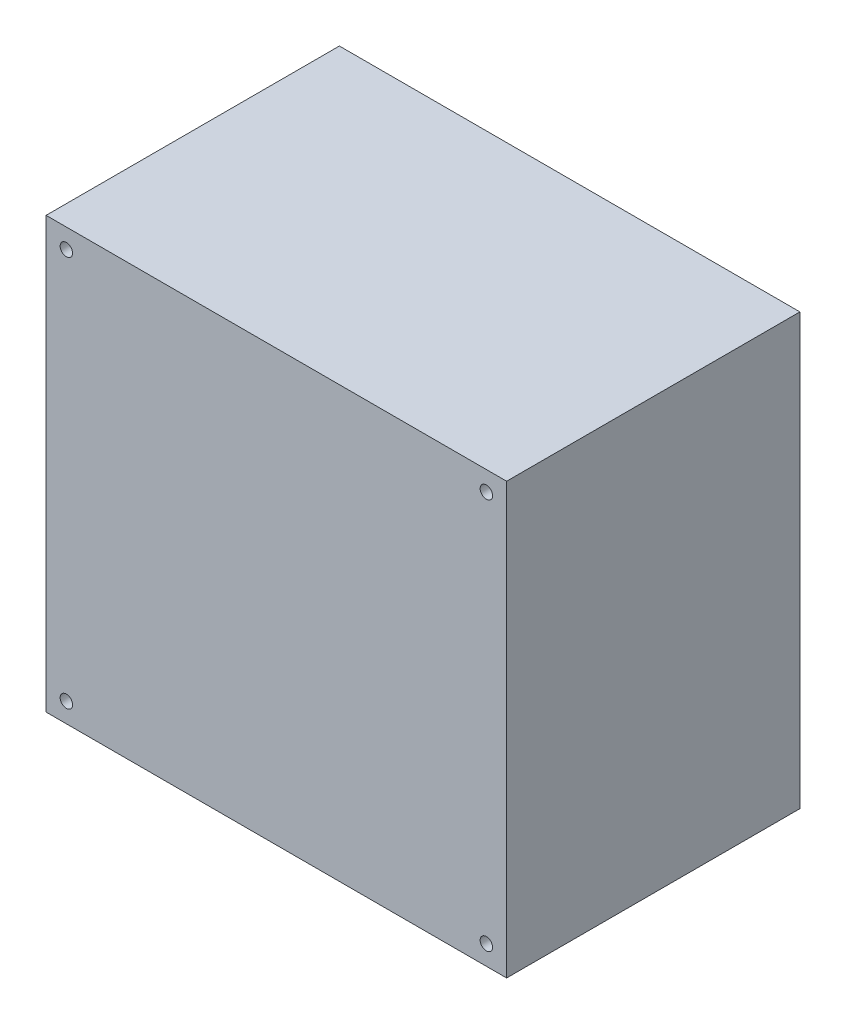
ISO-10303-21;
HEADER;
FILE_DESCRIPTION(('STEP AP214'),'2;1');
FILE_NAME('part.step','',(''),(''),'','','');
FILE_SCHEMA(('AUTOMOTIVE_DESIGN { 1 0 10303 214 1 1 1 1 }'));
ENDSEC;
DATA;
#1=APPLICATION_CONTEXT('core data for automotive mechanical design processes');
#2=APPLICATION_PROTOCOL_DEFINITION('international standard','automotive_design',2000,#1);
#3=PRODUCT_CONTEXT('',#1,'mechanical');
#4=PRODUCT('Part','Part','',(#3));
#5=PRODUCT_RELATED_PRODUCT_CATEGORY('part','',(#4));
#6=PRODUCT_DEFINITION_FORMATION('','',#4);
#7=PRODUCT_DEFINITION_CONTEXT('part definition',#1,'design');
#8=PRODUCT_DEFINITION('design','',#6,#7);
#9=PRODUCT_DEFINITION_SHAPE('','',#8);
#10=(LENGTH_UNIT() NAMED_UNIT(*) SI_UNIT(.MILLI.,.METRE.));
#11=(NAMED_UNIT(*) PLANE_ANGLE_UNIT() SI_UNIT($,.RADIAN.));
#12=(NAMED_UNIT(*) SI_UNIT($,.STERADIAN.) SOLID_ANGLE_UNIT());
#13=UNCERTAINTY_MEASURE_WITH_UNIT(LENGTH_MEASURE(1.E-05),#10,'distance_accuracy_value','');
#14=(GEOMETRIC_REPRESENTATION_CONTEXT(3) GLOBAL_UNCERTAINTY_ASSIGNED_CONTEXT((#13)) GLOBAL_UNIT_ASSIGNED_CONTEXT((#10,
#11,#12)) REPRESENTATION_CONTEXT('',''));
#15=CARTESIAN_POINT('',(0.,0.,0.));
#16=DIRECTION('',(0.,0.,1.));
#17=DIRECTION('',(1.,0.,0.));
#18=AXIS2_PLACEMENT_3D('',#15,#16,#17);
#19=CARTESIAN_POINT('',(38.,-35.5,60.));
#20=DIRECTION('',(-1.,0.,0.));
#21=DIRECTION('',(0.,0.,1.));
#22=AXIS2_PLACEMENT_3D('',#19,#20,#21);
#23=PLANE('',#22);
#24=CARTESIAN_POINT('',(38.,-35.5000166733525,11.599947536076));
#25=DIRECTION('',(0.,1.,0.));
#26=VECTOR('',#25,1.);
#27=LINE('',#24,#26);
#28=CARTESIAN_POINT('',(37.9999833266475,-35.5000166733525,11.599947536076));
#29=VERTEX_POINT('',#28);
#30=CARTESIAN_POINT('',(37.9999833266475,35.4999833266475,11.599947536076));
#31=VERTEX_POINT('',#30);
#32=EDGE_CURVE('E79',#29,#31,#27,.T.);
#33=ORIENTED_EDGE('',*,*,#32,.T.);
#34=DIRECTION('',(0.,0.,-1.));
#35=VECTOR('',#34,1.);
#36=CARTESIAN_POINT('',(38.,35.5,60.));
#37=LINE('',#36,#35);
#38=CARTESIAN_POINT('',(38.,35.5,60.));
#39=VERTEX_POINT('',#38);
#40=EDGE_CURVE('E11',#39,#31,#37,.T.);
#41=ORIENTED_EDGE('',*,*,#40,.F.);
#42=DIRECTION('',(0.,1.,0.));
#43=VECTOR('',#42,1.);
#44=CARTESIAN_POINT('',(38.,-35.5,60.));
#45=LINE('',#44,#43);
#46=CARTESIAN_POINT('',(38.,-35.5,60.));
#47=VERTEX_POINT('',#46);
#48=EDGE_CURVE('E70',#47,#39,#45,.T.);
#49=ORIENTED_EDGE('',*,*,#48,.F.);
#50=DIRECTION('',(0.,0.,-1.));
#51=VECTOR('',#50,1.);
#52=CARTESIAN_POINT('',(38.,-35.5,60.));
#53=LINE('',#52,#51);
#54=EDGE_CURVE('E81',#47,#29,#53,.T.);
#55=ORIENTED_EDGE('',*,*,#54,.T.);
#56=EDGE_LOOP('',(#33,#41,#49,#55));
#57=FACE_BOUND('',#56,.T.);
#58=ADVANCED_FACE('F17',(#57),#23,.F.);
#59=CARTESIAN_POINT('',(38.,35.5,60.));
#60=DIRECTION('',(0.,-1.,0.));
#61=DIRECTION('',(0.,0.,-1.));
#62=AXIS2_PLACEMENT_3D('',#59,#60,#61);
#63=PLANE('',#62);
#64=CARTESIAN_POINT('',(37.9999833266475,35.5,11.599947536076));
#65=DIRECTION('',(-1.,0.,0.));
#66=VECTOR('',#65,1.);
#67=LINE('',#64,#66);
#68=CARTESIAN_POINT('',(-38.0000166733525,35.4999833266475,11.599947536076));
#69=VERTEX_POINT('',#68);
#70=EDGE_CURVE('E85',#31,#69,#67,.T.);
#71=ORIENTED_EDGE('',*,*,#70,.T.);
#72=DIRECTION('',(0.,0.,-1.));
#73=VECTOR('',#72,1.);
#74=CARTESIAN_POINT('',(-38.,35.5,60.));
#75=LINE('',#74,#73);
#76=CARTESIAN_POINT('',(-38.,35.5,60.));
#77=VERTEX_POINT('',#76);
#78=EDGE_CURVE('E29',#77,#69,#75,.T.);
#79=ORIENTED_EDGE('',*,*,#78,.F.);
#80=DIRECTION('',(-1.,0.,0.));
#81=VECTOR('',#80,1.);
#82=CARTESIAN_POINT('',(38.,35.5,60.));
#83=LINE('',#82,#81);
#84=EDGE_CURVE('E66',#39,#77,#83,.T.);
#85=ORIENTED_EDGE('',*,*,#84,.F.);
#86=ORIENTED_EDGE('',*,*,#40,.T.);
#87=EDGE_LOOP('',(#71,#79,#85,#86));
#88=FACE_BOUND('',#87,.T.);
#89=ADVANCED_FACE('F67',(#88),#63,.F.);
#90=CARTESIAN_POINT('',(-38.,35.5,60.));
#91=DIRECTION('',(1.,0.,0.));
#92=DIRECTION('',(0.,0.,-1.));
#93=AXIS2_PLACEMENT_3D('',#90,#91,#92);
#94=PLANE('',#93);
#95=CARTESIAN_POINT('',(-38.,35.4999833266475,11.599947536076));
#96=DIRECTION('',(0.,-1.,0.));
#97=VECTOR('',#96,1.);
#98=LINE('',#95,#97);
#99=CARTESIAN_POINT('',(-38.0000166733525,-35.5000166733525,11.599947536076));
#100=VERTEX_POINT('',#99);
#101=EDGE_CURVE('E55',#69,#100,#98,.T.);
#102=ORIENTED_EDGE('',*,*,#101,.T.);
#103=DIRECTION('',(0.,0.,-1.));
#104=VECTOR('',#103,1.);
#105=CARTESIAN_POINT('',(-38.,-35.5,60.));
#106=LINE('',#105,#104);
#107=CARTESIAN_POINT('',(-38.,-35.5,60.));
#108=VERTEX_POINT('',#107);
#109=EDGE_CURVE('E206',#108,#100,#106,.T.);
#110=ORIENTED_EDGE('',*,*,#109,.F.);
#111=DIRECTION('',(0.,-1.,0.));
#112=VECTOR('',#111,1.);
#113=CARTESIAN_POINT('',(-38.,35.5,60.));
#114=LINE('',#113,#112);
#115=EDGE_CURVE('E38',#77,#108,#114,.T.);
#116=ORIENTED_EDGE('',*,*,#115,.F.);
#117=ORIENTED_EDGE('',*,*,#78,.T.);
#118=EDGE_LOOP('',(#102,#110,#116,#117));
#119=FACE_BOUND('',#118,.T.);
#120=ADVANCED_FACE('F105',(#119),#94,.F.);
#121=CARTESIAN_POINT('',(-38.,-35.5,60.));
#122=DIRECTION('',(0.,1.,0.));
#123=DIRECTION('',(0.,0.,1.));
#124=AXIS2_PLACEMENT_3D('',#121,#122,#123);
#125=PLANE('',#124);
#126=CARTESIAN_POINT('',(-38.0000166733525,-35.5,11.599947536076));
#127=DIRECTION('',(1.,0.,0.));
#128=VECTOR('',#127,1.);
#129=LINE('',#126,#128);
#130=EDGE_CURVE('E76',#100,#29,#129,.T.);
#131=ORIENTED_EDGE('',*,*,#130,.T.);
#132=ORIENTED_EDGE('',*,*,#54,.F.);
#133=DIRECTION('',(1.,0.,0.));
#134=VECTOR('',#133,1.);
#135=CARTESIAN_POINT('',(-38.,-35.5,60.));
#136=LINE('',#135,#134);
#137=EDGE_CURVE('E61',#108,#47,#136,.T.);
#138=ORIENTED_EDGE('',*,*,#137,.F.);
#139=ORIENTED_EDGE('',*,*,#109,.T.);
#140=EDGE_LOOP('',(#131,#132,#138,#139));
#141=FACE_BOUND('',#140,.T.);
#142=ADVANCED_FACE('F149',(#141),#125,.F.);
#143=CARTESIAN_POINT('',(0.,0.,60.));
#144=DIRECTION('',(0.,0.,1.));
#145=DIRECTION('',(1.,0.,0.));
#146=AXIS2_PLACEMENT_3D('',#143,#144,#145);
#147=PLANE('',#146);
#148=CARTESIAN_POINT('',(-34.657,-32.2695,60.));
#149=DIRECTION('',(0.,0.,1.));
#150=DIRECTION('',(1.,0.,0.));
#151=AXIS2_PLACEMENT_3D('',#148,#149,#150);
#152=CIRCLE('',#151,1.025);
#153=CARTESIAN_POINT('',(-33.632,-32.2695,60.));
#154=VERTEX_POINT('',#153);
#155=EDGE_CURVE('E182',#154,#154,#152,.T.);
#156=ORIENTED_EDGE('',*,*,#155,.F.);
#157=EDGE_LOOP('',(#156));
#158=FACE_BOUND('',#157,.T.);
#159=CARTESIAN_POINT('',(34.657,-32.2695,60.));
#160=DIRECTION('',(0.,0.,1.));
#161=DIRECTION('',(1.,0.,0.));
#162=AXIS2_PLACEMENT_3D('',#159,#160,#161);
#163=CIRCLE('',#162,1.025);
#164=CARTESIAN_POINT('',(35.682,-32.2695,60.));
#165=VERTEX_POINT('',#164);
#166=EDGE_CURVE('E195',#165,#165,#163,.T.);
#167=ORIENTED_EDGE('',*,*,#166,.F.);
#168=EDGE_LOOP('',(#167));
#169=FACE_BOUND('',#168,.T.);
#170=CARTESIAN_POINT('',(34.657,32.2695,60.));
#171=DIRECTION('',(0.,0.,1.));
#172=DIRECTION('',(1.,0.,0.));
#173=AXIS2_PLACEMENT_3D('',#170,#171,#172);
#174=CIRCLE('',#173,1.025);
#175=CARTESIAN_POINT('',(35.682,32.2695,60.));
#176=VERTEX_POINT('',#175);
#177=EDGE_CURVE('E199',#176,#176,#174,.T.);
#178=ORIENTED_EDGE('',*,*,#177,.F.);
#179=EDGE_LOOP('',(#178));
#180=FACE_BOUND('',#179,.T.);
#181=CARTESIAN_POINT('',(-34.657,32.2695,60.));
#182=DIRECTION('',(0.,0.,1.));
#183=DIRECTION('',(1.,0.,0.));
#184=AXIS2_PLACEMENT_3D('',#181,#182,#183);
#185=CIRCLE('',#184,1.025);
#186=CARTESIAN_POINT('',(-33.632,32.2695,60.));
#187=VERTEX_POINT('',#186);
#188=EDGE_CURVE('E86',#187,#187,#185,.T.);
#189=ORIENTED_EDGE('',*,*,#188,.F.);
#190=EDGE_LOOP('',(#189));
#191=FACE_BOUND('',#190,.T.);
#192=ORIENTED_EDGE('',*,*,#48,.T.);
#193=ORIENTED_EDGE('',*,*,#84,.T.);
#194=ORIENTED_EDGE('',*,*,#115,.T.);
#195=ORIENTED_EDGE('',*,*,#137,.T.);
#196=EDGE_LOOP('',(#192,#193,#194,#195));
#197=FACE_BOUND('',#196,.T.);
#198=ADVANCED_FACE('F73',(#158,#169,#180,#191,#197),#147,.T.);
#199=CARTESIAN_POINT('',(-1.6673352488874E-05,-1.66733524890261E-05,11.599947536076));
#200=DIRECTION('',(0.,0.,1.));
#201=DIRECTION('',(1.,0.,0.));
#202=AXIS2_PLACEMENT_3D('',#199,#200,#201);
#203=PLANE('',#202);
#204=CARTESIAN_POINT('',(-34.657,-32.2695,11.599947536076));
#205=DIRECTION('',(0.,0.,1.));
#206=DIRECTION('',(1.,0.,0.));
#207=AXIS2_PLACEMENT_3D('',#204,#205,#206);
#208=CIRCLE('',#207,1.025);
#209=CARTESIAN_POINT('',(-33.632,-32.2695,11.599947536076));
#210=VERTEX_POINT('',#209);
#211=EDGE_CURVE('E185',#210,#210,#208,.T.);
#212=ORIENTED_EDGE('',*,*,#211,.T.);
#213=EDGE_LOOP('',(#212));
#214=FACE_BOUND('',#213,.T.);
#215=CARTESIAN_POINT('',(34.657,-32.2695,11.599947536076));
#216=DIRECTION('',(0.,0.,1.));
#217=DIRECTION('',(1.,0.,0.));
#218=AXIS2_PLACEMENT_3D('',#215,#216,#217);
#219=CIRCLE('',#218,1.025);
#220=CARTESIAN_POINT('',(35.682,-32.2695,11.599947536076));
#221=VERTEX_POINT('',#220);
#222=EDGE_CURVE('E188',#221,#221,#219,.T.);
#223=ORIENTED_EDGE('',*,*,#222,.T.);
#224=EDGE_LOOP('',(#223));
#225=FACE_BOUND('',#224,.T.);
#226=CARTESIAN_POINT('',(34.657,32.2695,11.599947536076));
#227=DIRECTION('',(0.,0.,1.));
#228=DIRECTION('',(1.,0.,0.));
#229=AXIS2_PLACEMENT_3D('',#226,#227,#228);
#230=CIRCLE('',#229,1.025);
#231=CARTESIAN_POINT('',(35.682,32.2695,11.599947536076));
#232=VERTEX_POINT('',#231);
#233=EDGE_CURVE('E196',#232,#232,#230,.T.);
#234=ORIENTED_EDGE('',*,*,#233,.T.);
#235=EDGE_LOOP('',(#234));
#236=FACE_BOUND('',#235,.T.);
#237=CARTESIAN_POINT('',(-34.657,32.2695,11.599947536076));
#238=DIRECTION('',(0.,0.,1.));
#239=DIRECTION('',(1.,0.,0.));
#240=AXIS2_PLACEMENT_3D('',#237,#238,#239);
#241=CIRCLE('',#240,1.025);
#242=CARTESIAN_POINT('',(-33.632,32.2695,11.599947536076));
#243=VERTEX_POINT('',#242);
#244=EDGE_CURVE('E200',#243,#243,#241,.T.);
#245=ORIENTED_EDGE('',*,*,#244,.T.);
#246=EDGE_LOOP('',(#245));
#247=FACE_BOUND('',#246,.T.);
#248=ORIENTED_EDGE('',*,*,#32,.F.);
#249=ORIENTED_EDGE('',*,*,#130,.F.);
#250=ORIENTED_EDGE('',*,*,#101,.F.);
#251=ORIENTED_EDGE('',*,*,#70,.F.);
#252=EDGE_LOOP('',(#248,#249,#250,#251));
#253=FACE_BOUND('',#252,.T.);
#254=ADVANCED_FACE('F19',(#214,#225,#236,#247,#253),#203,.F.);
#255=CARTESIAN_POINT('',(-34.657,32.2695,0.));
#256=DIRECTION('',(0.,0.,1.));
#257=DIRECTION('',(1.,0.,0.));
#258=AXIS2_PLACEMENT_3D('',#255,#256,#257);
#259=CYLINDRICAL_SURFACE('',#258,1.025);
#260=ORIENTED_EDGE('',*,*,#188,.T.);
#261=EDGE_LOOP('',(#260));
#262=FACE_BOUND('',#261,.T.);
#263=ORIENTED_EDGE('',*,*,#244,.F.);
#264=EDGE_LOOP('',(#263));
#265=FACE_BOUND('',#264,.T.);
#266=ADVANCED_FACE('F161',(#262,#265),#259,.F.);
#267=CARTESIAN_POINT('',(34.657,32.2695,0.));
#268=DIRECTION('',(0.,0.,1.));
#269=DIRECTION('',(1.,0.,0.));
#270=AXIS2_PLACEMENT_3D('',#267,#268,#269);
#271=CYLINDRICAL_SURFACE('',#270,1.025);
#272=ORIENTED_EDGE('',*,*,#177,.T.);
#273=EDGE_LOOP('',(#272));
#274=FACE_BOUND('',#273,.T.);
#275=ORIENTED_EDGE('',*,*,#233,.F.);
#276=EDGE_LOOP('',(#275));
#277=FACE_BOUND('',#276,.T.);
#278=ADVANCED_FACE('F164',(#274,#277),#271,.F.);
#279=CARTESIAN_POINT('',(34.657,-32.2695,0.));
#280=DIRECTION('',(0.,0.,1.));
#281=DIRECTION('',(1.,0.,0.));
#282=AXIS2_PLACEMENT_3D('',#279,#280,#281);
#283=CYLINDRICAL_SURFACE('',#282,1.025);
#284=ORIENTED_EDGE('',*,*,#166,.T.);
#285=EDGE_LOOP('',(#284));
#286=FACE_BOUND('',#285,.T.);
#287=ORIENTED_EDGE('',*,*,#222,.F.);
#288=EDGE_LOOP('',(#287));
#289=FACE_BOUND('',#288,.T.);
#290=ADVANCED_FACE('F168',(#286,#289),#283,.F.);
#291=CARTESIAN_POINT('',(-34.657,-32.2695,0.));
#292=DIRECTION('',(0.,0.,1.));
#293=DIRECTION('',(1.,0.,0.));
#294=AXIS2_PLACEMENT_3D('',#291,#292,#293);
#295=CYLINDRICAL_SURFACE('',#294,1.025);
#296=ORIENTED_EDGE('',*,*,#155,.T.);
#297=EDGE_LOOP('',(#296));
#298=FACE_BOUND('',#297,.T.);
#299=ORIENTED_EDGE('',*,*,#211,.F.);
#300=EDGE_LOOP('',(#299));
#301=FACE_BOUND('',#300,.T.);
#302=ADVANCED_FACE('F172',(#298,#301),#295,.F.);
#303=CLOSED_SHELL('',(#58,#89,#120,#142,#198,#254,#266,#278,#290,#302));
#304=MANIFOLD_SOLID_BREP('B1',#303);
#305=ADVANCED_BREP_SHAPE_REPRESENTATION('',(#18,#304),#14);
#306=SHAPE_DEFINITION_REPRESENTATION(#9,#305);
ENDSEC;
END-ISO-10303-21;
